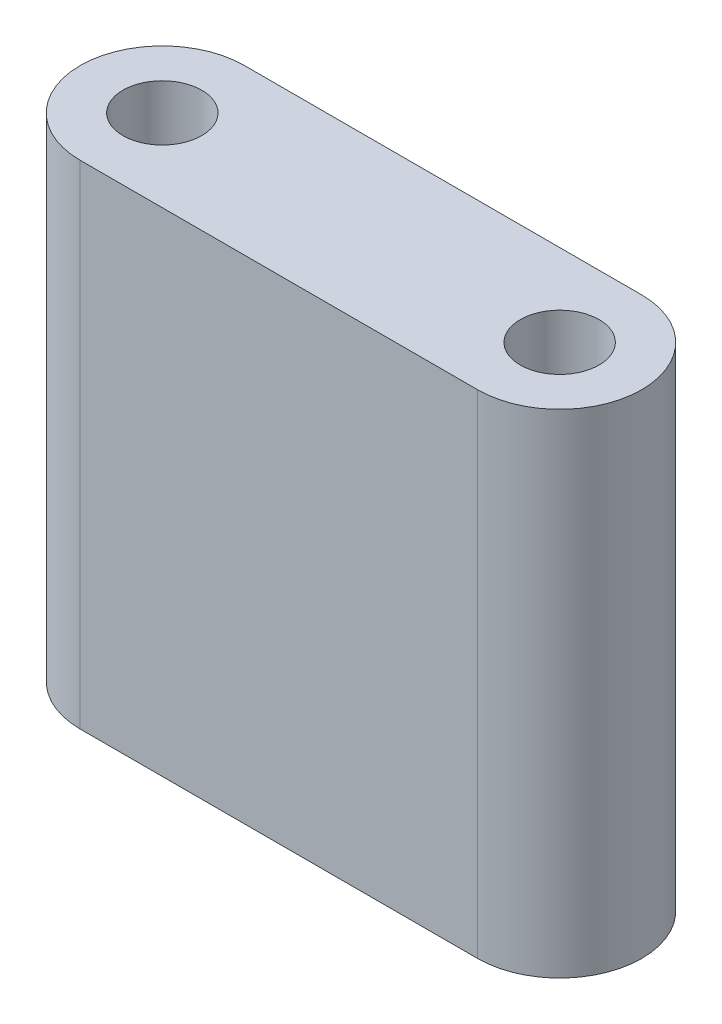
ISO-10303-21;
HEADER;
FILE_DESCRIPTION(('STEP AP214'),'2;1');
FILE_NAME('part.step','',(''),(''),'','','');
FILE_SCHEMA(('AUTOMOTIVE_DESIGN { 1 0 10303 214 1 1 1 1 }'));
ENDSEC;
DATA;
#1=APPLICATION_CONTEXT('core data for automotive mechanical design processes');
#2=APPLICATION_PROTOCOL_DEFINITION('international standard','automotive_design',2000,#1);
#3=PRODUCT_CONTEXT('',#1,'mechanical');
#4=PRODUCT('Part','Part','',(#3));
#5=PRODUCT_RELATED_PRODUCT_CATEGORY('part','',(#4));
#6=PRODUCT_DEFINITION_FORMATION('','',#4);
#7=PRODUCT_DEFINITION_CONTEXT('part definition',#1,'design');
#8=PRODUCT_DEFINITION('design','',#6,#7);
#9=PRODUCT_DEFINITION_SHAPE('','',#8);
#10=(LENGTH_UNIT() NAMED_UNIT(*) SI_UNIT(.MILLI.,.METRE.));
#11=(NAMED_UNIT(*) PLANE_ANGLE_UNIT() SI_UNIT($,.RADIAN.));
#12=(NAMED_UNIT(*) SI_UNIT($,.STERADIAN.) SOLID_ANGLE_UNIT());
#13=UNCERTAINTY_MEASURE_WITH_UNIT(LENGTH_MEASURE(1.E-05),#10,'distance_accuracy_value','');
#14=(GEOMETRIC_REPRESENTATION_CONTEXT(3) GLOBAL_UNCERTAINTY_ASSIGNED_CONTEXT((#13)) GLOBAL_UNIT_ASSIGNED_CONTEXT((#10,
#11,#12)) REPRESENTATION_CONTEXT('',''));
#15=CARTESIAN_POINT('',(0.,0.,0.));
#16=DIRECTION('',(0.,0.,1.));
#17=DIRECTION('',(1.,0.,0.));
#18=AXIS2_PLACEMENT_3D('',#15,#16,#17);
#19=CARTESIAN_POINT('',(0.,15.,-2.5));
#20=DIRECTION('',(0.,0.,-1.));
#21=DIRECTION('',(-1.,0.,0.));
#22=AXIS2_PLACEMENT_3D('',#19,#20,#21);
#23=PLANE('',#22);
#24=DIRECTION('',(1.,0.,0.));
#25=VECTOR('',#24,1.);
#26=CARTESIAN_POINT('',(0.,0.,-2.5));
#27=LINE('',#26,#25);
#28=CARTESIAN_POINT('',(-6.05,0.,-2.5));
#29=VERTEX_POINT('',#28);
#30=CARTESIAN_POINT('',(6.05,0.,-2.5));
#31=VERTEX_POINT('',#30);
#32=EDGE_CURVE('E110',#29,#31,#27,.T.);
#33=ORIENTED_EDGE('',*,*,#32,.F.);
#34=DIRECTION('',(0.,-1.,0.));
#35=VECTOR('',#34,1.);
#36=CARTESIAN_POINT('',(-6.05,15.,-2.5));
#37=LINE('',#36,#35);
#38=CARTESIAN_POINT('',(-6.05,15.,-2.5));
#39=VERTEX_POINT('',#38);
#40=EDGE_CURVE('E11',#39,#29,#37,.T.);
#41=ORIENTED_EDGE('',*,*,#40,.F.);
#42=DIRECTION('',(1.,0.,0.));
#43=VECTOR('',#42,1.);
#44=CARTESIAN_POINT('',(0.,15.,-2.5));
#45=LINE('',#44,#43);
#46=CARTESIAN_POINT('',(6.05,15.,-2.5));
#47=VERTEX_POINT('',#46);
#48=EDGE_CURVE('E92',#39,#47,#45,.T.);
#49=ORIENTED_EDGE('',*,*,#48,.T.);
#50=DIRECTION('',(0.,-1.,0.));
#51=VECTOR('',#50,1.);
#52=CARTESIAN_POINT('',(6.05,15.,-2.5));
#53=LINE('',#52,#51);
#54=EDGE_CURVE('E80',#47,#31,#53,.T.);
#55=ORIENTED_EDGE('',*,*,#54,.T.);
#56=EDGE_LOOP('',(#33,#41,#49,#55));
#57=FACE_BOUND('',#56,.T.);
#58=ADVANCED_FACE('F41',(#57),#23,.T.);
#59=CARTESIAN_POINT('',(-6.05,15.,0.));
#60=DIRECTION('',(0.,-1.,0.));
#61=DIRECTION('',(0.,0.,-1.));
#62=AXIS2_PLACEMENT_3D('',#59,#60,#61);
#63=CYLINDRICAL_SURFACE('',#62,2.5);
#64=CARTESIAN_POINT('',(-6.05,0.,0.));
#65=DIRECTION('',(0.,1.,0.));
#66=DIRECTION('',(0.,0.,1.));
#67=AXIS2_PLACEMENT_3D('',#64,#65,#66);
#68=CIRCLE('',#67,2.5);
#69=CARTESIAN_POINT('',(-6.05,0.,2.5));
#70=VERTEX_POINT('',#69);
#71=EDGE_CURVE('E97',#29,#70,#68,.T.);
#72=ORIENTED_EDGE('',*,*,#71,.T.);
#73=DIRECTION('',(0.,-1.,0.));
#74=VECTOR('',#73,1.);
#75=CARTESIAN_POINT('',(-6.05,15.,2.5));
#76=LINE('',#75,#74);
#77=CARTESIAN_POINT('',(-6.05,15.,2.5));
#78=VERTEX_POINT('',#77);
#79=EDGE_CURVE('E49',#78,#70,#76,.T.);
#80=ORIENTED_EDGE('',*,*,#79,.F.);
#81=CARTESIAN_POINT('',(-6.05,15.,0.));
#82=DIRECTION('',(0.,1.,0.));
#83=DIRECTION('',(0.,0.,1.));
#84=AXIS2_PLACEMENT_3D('',#81,#82,#83);
#85=CIRCLE('',#84,2.5);
#86=EDGE_CURVE('E86',#39,#78,#85,.T.);
#87=ORIENTED_EDGE('',*,*,#86,.F.);
#88=ORIENTED_EDGE('',*,*,#40,.T.);
#89=EDGE_LOOP('',(#72,#80,#87,#88));
#90=FACE_BOUND('',#89,.T.);
#91=ADVANCED_FACE('F95',(#90),#63,.T.);
#92=CARTESIAN_POINT('',(0.,15.,2.5));
#93=DIRECTION('',(0.,0.,-1.));
#94=DIRECTION('',(-1.,0.,0.));
#95=AXIS2_PLACEMENT_3D('',#92,#93,#94);
#96=PLANE('',#95);
#97=DIRECTION('',(1.,0.,0.));
#98=VECTOR('',#97,1.);
#99=CARTESIAN_POINT('',(0.,0.,2.5));
#100=LINE('',#99,#98);
#101=CARTESIAN_POINT('',(6.05,0.,2.5));
#102=VERTEX_POINT('',#101);
#103=EDGE_CURVE('E73',#70,#102,#100,.T.);
#104=ORIENTED_EDGE('',*,*,#103,.T.);
#105=DIRECTION('',(0.,-1.,0.));
#106=VECTOR('',#105,1.);
#107=CARTESIAN_POINT('',(6.05,15.,2.5));
#108=LINE('',#107,#106);
#109=CARTESIAN_POINT('',(6.05,15.,2.5));
#110=VERTEX_POINT('',#109);
#111=EDGE_CURVE('E98',#110,#102,#108,.T.);
#112=ORIENTED_EDGE('',*,*,#111,.F.);
#113=DIRECTION('',(1.,0.,0.));
#114=VECTOR('',#113,1.);
#115=CARTESIAN_POINT('',(0.,15.,2.5));
#116=LINE('',#115,#114);
#117=EDGE_CURVE('E91',#78,#110,#116,.T.);
#118=ORIENTED_EDGE('',*,*,#117,.F.);
#119=ORIENTED_EDGE('',*,*,#79,.T.);
#120=EDGE_LOOP('',(#104,#112,#118,#119));
#121=FACE_BOUND('',#120,.T.);
#122=ADVANCED_FACE('F99',(#121),#96,.F.);
#123=CARTESIAN_POINT('',(6.05,15.,0.));
#124=DIRECTION('',(0.,-1.,0.));
#125=DIRECTION('',(0.,0.,-1.));
#126=AXIS2_PLACEMENT_3D('',#123,#124,#125);
#127=CYLINDRICAL_SURFACE('',#126,1.2);
#128=CARTESIAN_POINT('',(6.05,15.,0.));
#129=DIRECTION('',(0.,1.,0.));
#130=DIRECTION('',(0.,0.,1.));
#131=AXIS2_PLACEMENT_3D('',#128,#129,#130);
#132=CIRCLE('',#131,1.2);
#133=CARTESIAN_POINT('',(6.05,15.,1.2));
#134=VERTEX_POINT('',#133);
#135=EDGE_CURVE('E101',#134,#134,#132,.T.);
#136=ORIENTED_EDGE('',*,*,#135,.T.);
#137=EDGE_LOOP('',(#136));
#138=FACE_BOUND('',#137,.T.);
#139=CARTESIAN_POINT('',(6.05,0.,0.));
#140=DIRECTION('',(0.,1.,0.));
#141=DIRECTION('',(0.,0.,1.));
#142=AXIS2_PLACEMENT_3D('',#139,#140,#141);
#143=CIRCLE('',#142,1.2);
#144=CARTESIAN_POINT('',(6.05,0.,1.2));
#145=VERTEX_POINT('',#144);
#146=EDGE_CURVE('E117',#145,#145,#143,.T.);
#147=ORIENTED_EDGE('',*,*,#146,.F.);
#148=EDGE_LOOP('',(#147));
#149=FACE_BOUND('',#148,.T.);
#150=ADVANCED_FACE('F137',(#138,#149),#127,.F.);
#151=CARTESIAN_POINT('',(6.05,15.,0.));
#152=DIRECTION('',(0.,-1.,0.));
#153=DIRECTION('',(0.,0.,-1.));
#154=AXIS2_PLACEMENT_3D('',#151,#152,#153);
#155=CYLINDRICAL_SURFACE('',#154,2.5);
#156=CARTESIAN_POINT('',(6.05,0.,0.));
#157=DIRECTION('',(0.,1.,0.));
#158=DIRECTION('',(0.,0.,1.));
#159=AXIS2_PLACEMENT_3D('',#156,#157,#158);
#160=CIRCLE('',#159,2.5);
#161=EDGE_CURVE('E115',#102,#31,#160,.T.);
#162=ORIENTED_EDGE('',*,*,#161,.T.);
#163=ORIENTED_EDGE('',*,*,#54,.F.);
#164=CARTESIAN_POINT('',(6.05,15.,0.));
#165=DIRECTION('',(0.,1.,0.));
#166=DIRECTION('',(0.,0.,1.));
#167=AXIS2_PLACEMENT_3D('',#164,#165,#166);
#168=CIRCLE('',#167,2.5);
#169=EDGE_CURVE('E57',#110,#47,#168,.T.);
#170=ORIENTED_EDGE('',*,*,#169,.F.);
#171=ORIENTED_EDGE('',*,*,#111,.T.);
#172=EDGE_LOOP('',(#162,#163,#170,#171));
#173=FACE_BOUND('',#172,.T.);
#174=ADVANCED_FACE('F126',(#173),#155,.T.);
#175=CARTESIAN_POINT('',(-6.05,15.,0.));
#176=DIRECTION('',(0.,-1.,0.));
#177=DIRECTION('',(0.,0.,-1.));
#178=AXIS2_PLACEMENT_3D('',#175,#176,#177);
#179=CYLINDRICAL_SURFACE('',#178,1.2);
#180=CARTESIAN_POINT('',(-6.05,15.,0.));
#181=DIRECTION('',(0.,1.,0.));
#182=DIRECTION('',(0.,0.,1.));
#183=AXIS2_PLACEMENT_3D('',#180,#181,#182);
#184=CIRCLE('',#183,1.2);
#185=CARTESIAN_POINT('',(-6.05,15.,1.2));
#186=VERTEX_POINT('',#185);
#187=EDGE_CURVE('E107',#186,#186,#184,.T.);
#188=ORIENTED_EDGE('',*,*,#187,.T.);
#189=EDGE_LOOP('',(#188));
#190=FACE_BOUND('',#189,.T.);
#191=CARTESIAN_POINT('',(-6.05,0.,0.));
#192=DIRECTION('',(0.,1.,0.));
#193=DIRECTION('',(0.,0.,1.));
#194=AXIS2_PLACEMENT_3D('',#191,#192,#193);
#195=CIRCLE('',#194,1.2);
#196=CARTESIAN_POINT('',(-6.05,0.,1.2));
#197=VERTEX_POINT('',#196);
#198=EDGE_CURVE('E120',#197,#197,#195,.T.);
#199=ORIENTED_EDGE('',*,*,#198,.F.);
#200=EDGE_LOOP('',(#199));
#201=FACE_BOUND('',#200,.T.);
#202=ADVANCED_FACE('F142',(#190,#201),#179,.F.);
#203=CARTESIAN_POINT('',(0.,15.,0.));
#204=DIRECTION('',(0.,1.,0.));
#205=DIRECTION('',(0.,0.,1.));
#206=AXIS2_PLACEMENT_3D('',#203,#204,#205);
#207=PLANE('',#206);
#208=ORIENTED_EDGE('',*,*,#48,.F.);
#209=ORIENTED_EDGE('',*,*,#86,.T.);
#210=ORIENTED_EDGE('',*,*,#117,.T.);
#211=ORIENTED_EDGE('',*,*,#169,.T.);
#212=EDGE_LOOP('',(#208,#209,#210,#211));
#213=FACE_BOUND('',#212,.T.);
#214=ORIENTED_EDGE('',*,*,#135,.F.);
#215=EDGE_LOOP('',(#214));
#216=FACE_BOUND('',#215,.T.);
#217=ORIENTED_EDGE('',*,*,#187,.F.);
#218=EDGE_LOOP('',(#217));
#219=FACE_BOUND('',#218,.T.);
#220=ADVANCED_FACE('F88',(#213,#216,#219),#207,.T.);
#221=CARTESIAN_POINT('',(0.,0.,0.));
#222=DIRECTION('',(0.,1.,0.));
#223=DIRECTION('',(0.,0.,1.));
#224=AXIS2_PLACEMENT_3D('',#221,#222,#223);
#225=PLANE('',#224);
#226=ORIENTED_EDGE('',*,*,#103,.F.);
#227=ORIENTED_EDGE('',*,*,#71,.F.);
#228=ORIENTED_EDGE('',*,*,#32,.T.);
#229=ORIENTED_EDGE('',*,*,#161,.F.);
#230=EDGE_LOOP('',(#226,#227,#228,#229));
#231=FACE_BOUND('',#230,.T.);
#232=ORIENTED_EDGE('',*,*,#146,.T.);
#233=EDGE_LOOP('',(#232));
#234=FACE_BOUND('',#233,.T.);
#235=ORIENTED_EDGE('',*,*,#198,.T.);
#236=EDGE_LOOP('',(#235));
#237=FACE_BOUND('',#236,.T.);
#238=ADVANCED_FACE('F128',(#231,#234,#237),#225,.F.);
#239=CLOSED_SHELL('',(#58,#91,#122,#150,#174,#202,#220,#238));
#240=MANIFOLD_SOLID_BREP('B2',#239);
#241=ADVANCED_BREP_SHAPE_REPRESENTATION('',(#18,#240),#14);
#242=SHAPE_DEFINITION_REPRESENTATION(#9,#241);
ENDSEC;
END-ISO-10303-21;
